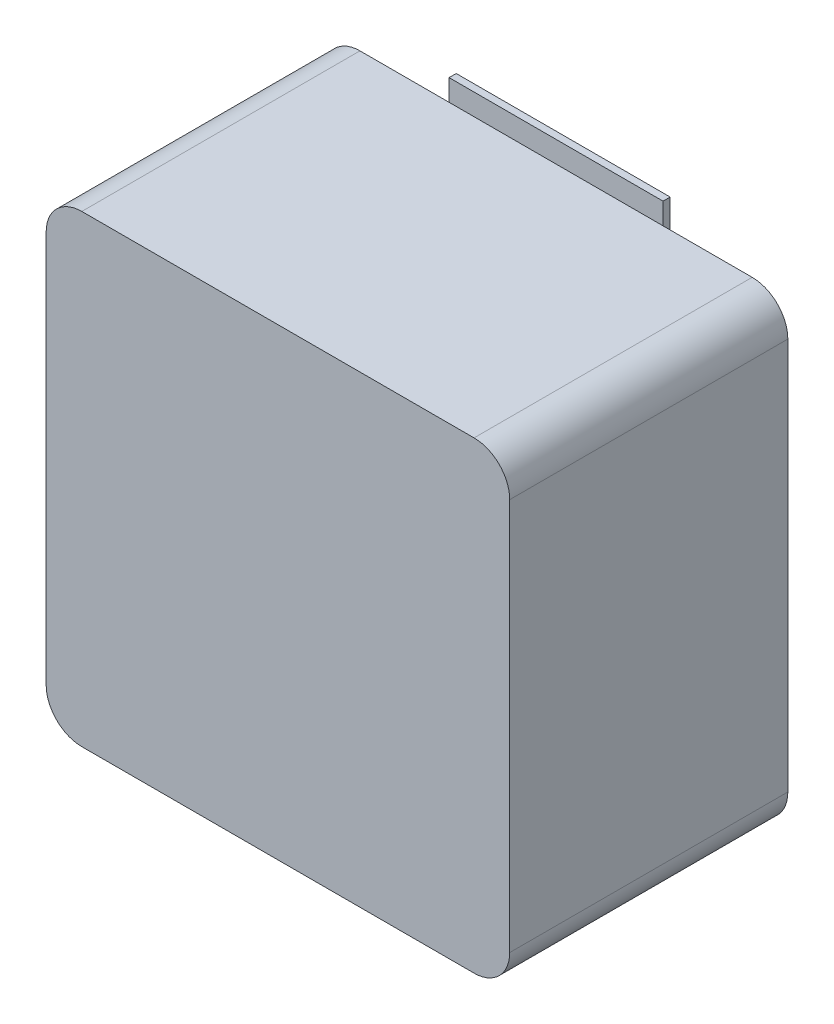
ISO-10303-21;
HEADER;
FILE_DESCRIPTION(('STEP AP214'),'2;1');
FILE_NAME('part.step','',(''),(''),'','','');
FILE_SCHEMA(('AUTOMOTIVE_DESIGN { 1 0 10303 214 1 1 1 1 }'));
ENDSEC;
DATA;
#1=APPLICATION_CONTEXT('core data for automotive mechanical design processes');
#2=APPLICATION_PROTOCOL_DEFINITION('international standard','automotive_design',2000,#1);
#3=PRODUCT_CONTEXT('',#1,'mechanical');
#4=PRODUCT('Part','Part','',(#3));
#5=PRODUCT_RELATED_PRODUCT_CATEGORY('part','',(#4));
#6=PRODUCT_DEFINITION_FORMATION('','',#4);
#7=PRODUCT_DEFINITION_CONTEXT('part definition',#1,'design');
#8=PRODUCT_DEFINITION('design','',#6,#7);
#9=PRODUCT_DEFINITION_SHAPE('','',#8);
#10=(LENGTH_UNIT() NAMED_UNIT(*) SI_UNIT(.MILLI.,.METRE.));
#11=(NAMED_UNIT(*) PLANE_ANGLE_UNIT() SI_UNIT($,.RADIAN.));
#12=(NAMED_UNIT(*) SI_UNIT($,.STERADIAN.) SOLID_ANGLE_UNIT());
#13=UNCERTAINTY_MEASURE_WITH_UNIT(LENGTH_MEASURE(1.E-05),#10,'distance_accuracy_value','');
#14=(GEOMETRIC_REPRESENTATION_CONTEXT(3) GLOBAL_UNCERTAINTY_ASSIGNED_CONTEXT((#13)) GLOBAL_UNIT_ASSIGNED_CONTEXT((#10,
#11,#12)) REPRESENTATION_CONTEXT('',''));
#15=CARTESIAN_POINT('',(0.,0.,0.));
#16=DIRECTION('',(0.,0.,1.));
#17=DIRECTION('',(1.,0.,0.));
#18=AXIS2_PLACEMENT_3D('',#15,#16,#17);
#19=CARTESIAN_POINT('',(0.,0.,0.));
#20=DIRECTION('',(0.,0.,-1.));
#21=DIRECTION('',(0.,-1.,0.));
#22=AXIS2_PLACEMENT_3D('',#19,#20,#21);
#23=PLANE('',#22);
#24=DIRECTION('',(-1.,0.,0.));
#25=VECTOR('',#24,1.);
#26=CARTESIAN_POINT('',(0.,3.25,0.));
#27=LINE('',#26,#25);
#28=CARTESIAN_POINT('',(1.5,3.25,0.));
#29=VERTEX_POINT('',#28);
#30=CARTESIAN_POINT('',(-1.5,3.25,0.));
#31=VERTEX_POINT('',#30);
#32=EDGE_CURVE('E197',#29,#31,#27,.T.);
#33=ORIENTED_EDGE('',*,*,#32,.F.);
#34=DIRECTION('',(0.,-1.,0.));
#35=VECTOR('',#34,1.);
#36=CARTESIAN_POINT('',(1.5,2.915,0.));
#37=LINE('',#36,#35);
#38=CARTESIAN_POINT('',(1.5,3.55,0.));
#39=VERTEX_POINT('',#38);
#40=EDGE_CURVE('E151',#39,#29,#37,.T.);
#41=ORIENTED_EDGE('',*,*,#40,.F.);
#42=DIRECTION('',(-1.,0.,0.));
#43=VECTOR('',#42,1.);
#44=CARTESIAN_POINT('',(0.,3.55,0.));
#45=LINE('',#44,#43);
#46=CARTESIAN_POINT('',(-1.5,3.55,0.));
#47=VERTEX_POINT('',#46);
#48=EDGE_CURVE('E180',#39,#47,#45,.T.);
#49=ORIENTED_EDGE('',*,*,#48,.T.);
#50=DIRECTION('',(0.,-1.,0.));
#51=VECTOR('',#50,1.);
#52=CARTESIAN_POINT('',(-1.5,2.915,0.));
#53=LINE('',#52,#51);
#54=EDGE_CURVE('E28',#47,#31,#53,.T.);
#55=ORIENTED_EDGE('',*,*,#54,.T.);
#56=EDGE_LOOP('',(#33,#41,#49,#55));
#57=FACE_BOUND('',#56,.T.);
#58=ADVANCED_FACE('F17',(#57),#23,.F.);
#59=CARTESIAN_POINT('',(0.,0.,-0.1));
#60=DIRECTION('',(0.,0.,-1.));
#61=DIRECTION('',(0.,-1.,0.));
#62=AXIS2_PLACEMENT_3D('',#59,#60,#61);
#63=PLANE('',#62);
#64=DIRECTION('',(-1.,0.,0.));
#65=VECTOR('',#64,1.);
#66=CARTESIAN_POINT('',(0.,3.55,-0.1));
#67=LINE('',#66,#65);
#68=CARTESIAN_POINT('',(1.5,3.55,-0.1));
#69=VERTEX_POINT('',#68);
#70=CARTESIAN_POINT('',(-1.5,3.55,-0.1));
#71=VERTEX_POINT('',#70);
#72=EDGE_CURVE('E253',#69,#71,#67,.T.);
#73=ORIENTED_EDGE('',*,*,#72,.F.);
#74=DIRECTION('',(0.,-1.,0.));
#75=VECTOR('',#74,1.);
#76=CARTESIAN_POINT('',(1.5,2.915,-0.1));
#77=LINE('',#76,#75);
#78=CARTESIAN_POINT('',(1.5,2.28,-0.1));
#79=VERTEX_POINT('',#78);
#80=EDGE_CURVE('E150',#69,#79,#77,.T.);
#81=ORIENTED_EDGE('',*,*,#80,.T.);
#82=DIRECTION('',(-1.,0.,0.));
#83=VECTOR('',#82,1.);
#84=CARTESIAN_POINT('',(0.,2.28,-0.1));
#85=LINE('',#84,#83);
#86=CARTESIAN_POINT('',(-1.5,2.28,-0.1));
#87=VERTEX_POINT('',#86);
#88=EDGE_CURVE('E146',#79,#87,#85,.T.);
#89=ORIENTED_EDGE('',*,*,#88,.T.);
#90=DIRECTION('',(0.,-1.,0.));
#91=VECTOR('',#90,1.);
#92=CARTESIAN_POINT('',(-1.5,2.915,-0.1));
#93=LINE('',#92,#91);
#94=EDGE_CURVE('E11',#71,#87,#93,.T.);
#95=ORIENTED_EDGE('',*,*,#94,.F.);
#96=EDGE_LOOP('',(#73,#81,#89,#95));
#97=FACE_BOUND('',#96,.T.);
#98=ADVANCED_FACE('F435',(#97),#63,.T.);
#99=CARTESIAN_POINT('',(-1.5,2.915,-0.1));
#100=DIRECTION('',(-1.,0.,0.));
#101=DIRECTION('',(0.,1.,0.));
#102=AXIS2_PLACEMENT_3D('',#99,#100,#101);
#103=PLANE('',#102);
#104=ORIENTED_EDGE('',*,*,#54,.F.);
#105=DIRECTION('',(0.,0.,1.));
#106=VECTOR('',#105,1.);
#107=CARTESIAN_POINT('',(-1.5,3.55,-0.1));
#108=LINE('',#107,#106);
#109=EDGE_CURVE('E261',#71,#47,#108,.T.);
#110=ORIENTED_EDGE('',*,*,#109,.F.);
#111=ORIENTED_EDGE('',*,*,#94,.T.);
#112=DIRECTION('',(0.,0.,1.));
#113=VECTOR('',#112,1.);
#114=CARTESIAN_POINT('',(-1.5,2.28,-0.1));
#115=LINE('',#114,#113);
#116=CARTESIAN_POINT('',(-1.5,2.28,0.));
#117=VERTEX_POINT('',#116);
#118=EDGE_CURVE('E213',#87,#117,#115,.T.);
#119=ORIENTED_EDGE('',*,*,#118,.T.);
#120=DIRECTION('',(0.,-1.,0.));
#121=VECTOR('',#120,1.);
#122=CARTESIAN_POINT('',(-1.5,2.915,0.));
#123=LINE('',#122,#121);
#124=EDGE_CURVE('E165',#31,#117,#123,.T.);
#125=ORIENTED_EDGE('',*,*,#124,.F.);
#126=EDGE_LOOP('',(#104,#110,#111,#119,#125));
#127=FACE_BOUND('',#126,.T.);
#128=ADVANCED_FACE('F440',(#127),#103,.T.);
#129=CARTESIAN_POINT('',(0.,2.28,-0.1));
#130=DIRECTION('',(0.,1.,0.));
#131=DIRECTION('',(1.,0.,0.));
#132=AXIS2_PLACEMENT_3D('',#129,#130,#131);
#133=PLANE('',#132);
#134=DIRECTION('',(-1.,0.,0.));
#135=VECTOR('',#134,1.);
#136=CARTESIAN_POINT('',(0.,2.28,0.));
#137=LINE('',#136,#135);
#138=CARTESIAN_POINT('',(1.5,2.28,0.));
#139=VERTEX_POINT('',#138);
#140=EDGE_CURVE('E144',#139,#117,#137,.T.);
#141=ORIENTED_EDGE('',*,*,#140,.T.);
#142=ORIENTED_EDGE('',*,*,#118,.F.);
#143=ORIENTED_EDGE('',*,*,#88,.F.);
#144=DIRECTION('',(0.,0.,1.));
#145=VECTOR('',#144,1.);
#146=CARTESIAN_POINT('',(1.5,2.28,-0.1));
#147=LINE('',#146,#145);
#148=EDGE_CURVE('E139',#79,#139,#147,.T.);
#149=ORIENTED_EDGE('',*,*,#148,.T.);
#150=EDGE_LOOP('',(#141,#142,#143,#149));
#151=FACE_BOUND('',#150,.T.);
#152=ADVANCED_FACE('F141',(#151),#133,.F.);
#153=CARTESIAN_POINT('',(1.5,2.915,-0.1));
#154=DIRECTION('',(-1.,0.,0.));
#155=DIRECTION('',(0.,1.,0.));
#156=AXIS2_PLACEMENT_3D('',#153,#154,#155);
#157=PLANE('',#156);
#158=ORIENTED_EDGE('',*,*,#40,.T.);
#159=DIRECTION('',(0.,-1.,0.));
#160=VECTOR('',#159,1.);
#161=CARTESIAN_POINT('',(1.5,2.915,0.));
#162=LINE('',#161,#160);
#163=EDGE_CURVE('E154',#29,#139,#162,.T.);
#164=ORIENTED_EDGE('',*,*,#163,.T.);
#165=ORIENTED_EDGE('',*,*,#148,.F.);
#166=ORIENTED_EDGE('',*,*,#80,.F.);
#167=DIRECTION('',(0.,0.,1.));
#168=VECTOR('',#167,1.);
#169=CARTESIAN_POINT('',(1.5,3.55,-0.1));
#170=LINE('',#169,#168);
#171=EDGE_CURVE('E247',#69,#39,#170,.T.);
#172=ORIENTED_EDGE('',*,*,#171,.T.);
#173=EDGE_LOOP('',(#158,#164,#165,#166,#172));
#174=FACE_BOUND('',#173,.T.);
#175=ADVANCED_FACE('F155',(#174),#157,.F.);
#176=CARTESIAN_POINT('',(0.,3.55,-0.1));
#177=DIRECTION('',(0.,1.,0.));
#178=DIRECTION('',(1.,0.,0.));
#179=AXIS2_PLACEMENT_3D('',#176,#177,#178);
#180=PLANE('',#179);
#181=ORIENTED_EDGE('',*,*,#48,.F.);
#182=ORIENTED_EDGE('',*,*,#171,.F.);
#183=ORIENTED_EDGE('',*,*,#72,.T.);
#184=ORIENTED_EDGE('',*,*,#109,.T.);
#185=EDGE_LOOP('',(#181,#182,#183,#184));
#186=FACE_BOUND('',#185,.T.);
#187=ADVANCED_FACE('F430',(#186),#180,.T.);
#188=CARTESIAN_POINT('',(0.,0.,-0.1));
#189=DIRECTION('',(0.,0.,-1.));
#190=DIRECTION('',(0.,-1.,0.));
#191=AXIS2_PLACEMENT_3D('',#188,#189,#190);
#192=PLANE('',#191);
#193=DIRECTION('',(-1.,0.,0.));
#194=VECTOR('',#193,1.);
#195=CARTESIAN_POINT('',(0.,-2.28,-0.1));
#196=LINE('',#195,#194);
#197=CARTESIAN_POINT('',(1.5,-2.28,-0.1));
#198=VERTEX_POINT('',#197);
#199=CARTESIAN_POINT('',(-1.5,-2.28,-0.1));
#200=VERTEX_POINT('',#199);
#201=EDGE_CURVE('E208',#198,#200,#196,.T.);
#202=ORIENTED_EDGE('',*,*,#201,.F.);
#203=DIRECTION('',(0.,-1.,0.));
#204=VECTOR('',#203,1.);
#205=CARTESIAN_POINT('',(1.5,-2.915,-0.1));
#206=LINE('',#205,#204);
#207=CARTESIAN_POINT('',(1.5,-3.55,-0.1));
#208=VERTEX_POINT('',#207);
#209=EDGE_CURVE('E301',#198,#208,#206,.T.);
#210=ORIENTED_EDGE('',*,*,#209,.T.);
#211=DIRECTION('',(-1.,0.,0.));
#212=VECTOR('',#211,1.);
#213=CARTESIAN_POINT('',(0.,-3.55,-0.1));
#214=LINE('',#213,#212);
#215=CARTESIAN_POINT('',(-1.5,-3.55,-0.1));
#216=VERTEX_POINT('',#215);
#217=EDGE_CURVE('E181',#208,#216,#214,.T.);
#218=ORIENTED_EDGE('',*,*,#217,.T.);
#219=DIRECTION('',(0.,-1.,0.));
#220=VECTOR('',#219,1.);
#221=CARTESIAN_POINT('',(-1.5,-2.915,-0.1));
#222=LINE('',#221,#220);
#223=EDGE_CURVE('E178',#200,#216,#222,.T.);
#224=ORIENTED_EDGE('',*,*,#223,.F.);
#225=EDGE_LOOP('',(#202,#210,#218,#224));
#226=FACE_BOUND('',#225,.T.);
#227=ADVANCED_FACE('F414',(#226),#192,.T.);
#228=CARTESIAN_POINT('',(-1.5,-2.915,-0.1));
#229=DIRECTION('',(-1.,0.,0.));
#230=DIRECTION('',(0.,0.,1.));
#231=AXIS2_PLACEMENT_3D('',#228,#229,#230);
#232=PLANE('',#231);
#233=DIRECTION('',(0.,-1.,0.));
#234=VECTOR('',#233,1.);
#235=CARTESIAN_POINT('',(-1.5,-2.915,0.));
#236=LINE('',#235,#234);
#237=CARTESIAN_POINT('',(-1.5,-2.28,0.));
#238=VERTEX_POINT('',#237);
#239=CARTESIAN_POINT('',(-1.5,-3.25,0.));
#240=VERTEX_POINT('',#239);
#241=EDGE_CURVE('E172',#238,#240,#236,.T.);
#242=ORIENTED_EDGE('',*,*,#241,.F.);
#243=DIRECTION('',(0.,0.,1.));
#244=VECTOR('',#243,1.);
#245=CARTESIAN_POINT('',(-1.5,-2.28,-0.1));
#246=LINE('',#245,#244);
#247=EDGE_CURVE('E211',#200,#238,#246,.T.);
#248=ORIENTED_EDGE('',*,*,#247,.F.);
#249=ORIENTED_EDGE('',*,*,#223,.T.);
#250=DIRECTION('',(0.,0.,1.));
#251=VECTOR('',#250,1.);
#252=CARTESIAN_POINT('',(-1.5,-3.55,-0.1));
#253=LINE('',#252,#251);
#254=CARTESIAN_POINT('',(-1.5,-3.55,0.));
#255=VERTEX_POINT('',#254);
#256=EDGE_CURVE('E297',#216,#255,#253,.T.);
#257=ORIENTED_EDGE('',*,*,#256,.T.);
#258=DIRECTION('',(0.,-1.,0.));
#259=VECTOR('',#258,1.);
#260=CARTESIAN_POINT('',(-1.5,-2.915,0.));
#261=LINE('',#260,#259);
#262=EDGE_CURVE('E207',#240,#255,#261,.T.);
#263=ORIENTED_EDGE('',*,*,#262,.F.);
#264=EDGE_LOOP('',(#242,#248,#249,#257,#263));
#265=FACE_BOUND('',#264,.T.);
#266=ADVANCED_FACE('F422',(#265),#232,.T.);
#267=CARTESIAN_POINT('',(0.,-3.55,-0.1));
#268=DIRECTION('',(0.,1.,0.));
#269=DIRECTION('',(1.,0.,0.));
#270=AXIS2_PLACEMENT_3D('',#267,#268,#269);
#271=PLANE('',#270);
#272=DIRECTION('',(-1.,0.,0.));
#273=VECTOR('',#272,1.);
#274=CARTESIAN_POINT('',(0.,-3.55,0.));
#275=LINE('',#274,#273);
#276=CARTESIAN_POINT('',(1.5,-3.55,0.));
#277=VERTEX_POINT('',#276);
#278=EDGE_CURVE('E21',#277,#255,#275,.T.);
#279=ORIENTED_EDGE('',*,*,#278,.T.);
#280=ORIENTED_EDGE('',*,*,#256,.F.);
#281=ORIENTED_EDGE('',*,*,#217,.F.);
#282=DIRECTION('',(0.,0.,1.));
#283=VECTOR('',#282,1.);
#284=CARTESIAN_POINT('',(1.5,-3.55,-0.1));
#285=LINE('',#284,#283);
#286=EDGE_CURVE('E332',#208,#277,#285,.T.);
#287=ORIENTED_EDGE('',*,*,#286,.T.);
#288=EDGE_LOOP('',(#279,#280,#281,#287));
#289=FACE_BOUND('',#288,.T.);
#290=ADVANCED_FACE('F19',(#289),#271,.F.);
#291=CARTESIAN_POINT('',(1.5,-2.915,-0.1));
#292=DIRECTION('',(-1.,0.,0.));
#293=DIRECTION('',(0.,0.,1.));
#294=AXIS2_PLACEMENT_3D('',#291,#292,#293);
#295=PLANE('',#294);
#296=DIRECTION('',(0.,-1.,0.));
#297=VECTOR('',#296,1.);
#298=CARTESIAN_POINT('',(1.5,-2.915,0.));
#299=LINE('',#298,#297);
#300=CARTESIAN_POINT('',(1.5,-2.28,0.));
#301=VERTEX_POINT('',#300);
#302=CARTESIAN_POINT('',(1.5,-3.25,0.));
#303=VERTEX_POINT('',#302);
#304=EDGE_CURVE('E203',#301,#303,#299,.T.);
#305=ORIENTED_EDGE('',*,*,#304,.T.);
#306=DIRECTION('',(0.,-1.,0.));
#307=VECTOR('',#306,1.);
#308=CARTESIAN_POINT('',(1.5,-2.915,0.));
#309=LINE('',#308,#307);
#310=EDGE_CURVE('E160',#303,#277,#309,.T.);
#311=ORIENTED_EDGE('',*,*,#310,.T.);
#312=ORIENTED_EDGE('',*,*,#286,.F.);
#313=ORIENTED_EDGE('',*,*,#209,.F.);
#314=DIRECTION('',(0.,0.,1.));
#315=VECTOR('',#314,1.);
#316=CARTESIAN_POINT('',(1.5,-2.28,-0.1));
#317=LINE('',#316,#315);
#318=EDGE_CURVE('E212',#198,#301,#317,.T.);
#319=ORIENTED_EDGE('',*,*,#318,.T.);
#320=EDGE_LOOP('',(#305,#311,#312,#313,#319));
#321=FACE_BOUND('',#320,.T.);
#322=ADVANCED_FACE('F369',(#321),#295,.F.);
#323=CARTESIAN_POINT('',(0.,-2.28,-0.1));
#324=DIRECTION('',(0.,1.,0.));
#325=DIRECTION('',(1.,0.,0.));
#326=AXIS2_PLACEMENT_3D('',#323,#324,#325);
#327=PLANE('',#326);
#328=DIRECTION('',(-1.,0.,0.));
#329=VECTOR('',#328,1.);
#330=CARTESIAN_POINT('',(0.,-2.28,0.));
#331=LINE('',#330,#329);
#332=EDGE_CURVE('E199',#301,#238,#331,.T.);
#333=ORIENTED_EDGE('',*,*,#332,.F.);
#334=ORIENTED_EDGE('',*,*,#318,.F.);
#335=ORIENTED_EDGE('',*,*,#201,.T.);
#336=ORIENTED_EDGE('',*,*,#247,.T.);
#337=EDGE_LOOP('',(#333,#334,#335,#336));
#338=FACE_BOUND('',#337,.T.);
#339=ADVANCED_FACE('F417',(#338),#327,.T.);
#340=CARTESIAN_POINT('',(0.,0.,0.));
#341=DIRECTION('',(0.,0.,-1.));
#342=DIRECTION('',(0.,-1.,0.));
#343=AXIS2_PLACEMENT_3D('',#340,#341,#342);
#344=PLANE('',#343);
#345=ORIENTED_EDGE('',*,*,#310,.F.);
#346=DIRECTION('',(-1.,0.,0.));
#347=VECTOR('',#346,1.);
#348=CARTESIAN_POINT('',(0.,-3.25,0.));
#349=LINE('',#348,#347);
#350=EDGE_CURVE('E185',#303,#240,#349,.T.);
#351=ORIENTED_EDGE('',*,*,#350,.T.);
#352=ORIENTED_EDGE('',*,*,#262,.T.);
#353=ORIENTED_EDGE('',*,*,#278,.F.);
#354=EDGE_LOOP('',(#345,#351,#352,#353));
#355=FACE_BOUND('',#354,.T.);
#356=ADVANCED_FACE('F366',(#355),#344,.F.);
#357=CARTESIAN_POINT('',(0.,0.,0.));
#358=DIRECTION('',(0.,0.,1.));
#359=DIRECTION('',(1.,0.,0.));
#360=AXIS2_PLACEMENT_3D('',#357,#358,#359);
#361=PLANE('',#360);
#362=DIRECTION('',(0.,1.,0.));
#363=VECTOR('',#362,1.);
#364=CARTESIAN_POINT('',(3.25,0.,0.));
#365=LINE('',#364,#363);
#366=CARTESIAN_POINT('',(3.25,-2.75,0.));
#367=VERTEX_POINT('',#366);
#368=CARTESIAN_POINT('',(3.25,2.75,0.));
#369=VERTEX_POINT('',#368);
#370=EDGE_CURVE('E279',#367,#369,#365,.T.);
#371=ORIENTED_EDGE('',*,*,#370,.F.);
#372=CARTESIAN_POINT('',(2.75,-2.75,0.));
#373=DIRECTION('',(0.,0.,-1.));
#374=DIRECTION('',(1.,0.,0.));
#375=AXIS2_PLACEMENT_3D('',#372,#373,#374);
#376=CIRCLE('',#375,0.5);
#377=CARTESIAN_POINT('',(2.75,-3.25,0.));
#378=VERTEX_POINT('',#377);
#379=EDGE_CURVE('E339',#367,#378,#376,.T.);
#380=ORIENTED_EDGE('',*,*,#379,.T.);
#381=DIRECTION('',(-1.,0.,0.));
#382=VECTOR('',#381,1.);
#383=CARTESIAN_POINT('',(0.,-3.25,0.));
#384=LINE('',#383,#382);
#385=EDGE_CURVE('E292',#378,#303,#384,.T.);
#386=ORIENTED_EDGE('',*,*,#385,.T.);
#387=ORIENTED_EDGE('',*,*,#304,.F.);
#388=ORIENTED_EDGE('',*,*,#332,.T.);
#389=ORIENTED_EDGE('',*,*,#241,.T.);
#390=DIRECTION('',(-1.,0.,0.));
#391=VECTOR('',#390,1.);
#392=CARTESIAN_POINT('',(0.,-3.25,0.));
#393=LINE('',#392,#391);
#394=CARTESIAN_POINT('',(-2.75,-3.25,0.));
#395=VERTEX_POINT('',#394);
#396=EDGE_CURVE('E182',#240,#395,#393,.T.);
#397=ORIENTED_EDGE('',*,*,#396,.T.);
#398=CARTESIAN_POINT('',(-2.75,-2.75,0.));
#399=DIRECTION('',(0.,0.,-1.));
#400=DIRECTION('',(1.,0.,0.));
#401=AXIS2_PLACEMENT_3D('',#398,#399,#400);
#402=CIRCLE('',#401,0.5);
#403=CARTESIAN_POINT('',(-3.25,-2.75,0.));
#404=VERTEX_POINT('',#403);
#405=EDGE_CURVE('E191',#395,#404,#402,.T.);
#406=ORIENTED_EDGE('',*,*,#405,.T.);
#407=DIRECTION('',(0.,1.,0.));
#408=VECTOR('',#407,1.);
#409=CARTESIAN_POINT('',(-3.25,0.,0.));
#410=LINE('',#409,#408);
#411=CARTESIAN_POINT('',(-3.25,2.75,0.));
#412=VERTEX_POINT('',#411);
#413=EDGE_CURVE('E268',#404,#412,#410,.T.);
#414=ORIENTED_EDGE('',*,*,#413,.T.);
#415=CARTESIAN_POINT('',(-2.75,2.75,0.));
#416=DIRECTION('',(0.,0.,-1.));
#417=DIRECTION('',(1.,0.,0.));
#418=AXIS2_PLACEMENT_3D('',#415,#416,#417);
#419=CIRCLE('',#418,0.5);
#420=CARTESIAN_POINT('',(-2.75,3.25,0.));
#421=VERTEX_POINT('',#420);
#422=EDGE_CURVE('E321',#412,#421,#419,.T.);
#423=ORIENTED_EDGE('',*,*,#422,.T.);
#424=DIRECTION('',(-1.,0.,0.));
#425=VECTOR('',#424,1.);
#426=CARTESIAN_POINT('',(0.,3.25,0.));
#427=LINE('',#426,#425);
#428=EDGE_CURVE('E275',#31,#421,#427,.T.);
#429=ORIENTED_EDGE('',*,*,#428,.F.);
#430=ORIENTED_EDGE('',*,*,#124,.T.);
#431=ORIENTED_EDGE('',*,*,#140,.F.);
#432=ORIENTED_EDGE('',*,*,#163,.F.);
#433=DIRECTION('',(-1.,0.,0.));
#434=VECTOR('',#433,1.);
#435=CARTESIAN_POINT('',(0.,3.25,0.));
#436=LINE('',#435,#434);
#437=CARTESIAN_POINT('',(2.75,3.25,0.));
#438=VERTEX_POINT('',#437);
#439=EDGE_CURVE('E193',#438,#29,#436,.T.);
#440=ORIENTED_EDGE('',*,*,#439,.F.);
#441=CARTESIAN_POINT('',(2.75,2.75,0.));
#442=DIRECTION('',(0.,0.,-1.));
#443=DIRECTION('',(1.,0.,0.));
#444=AXIS2_PLACEMENT_3D('',#441,#442,#443);
#445=CIRCLE('',#444,0.5);
#446=EDGE_CURVE('E291',#438,#369,#445,.T.);
#447=ORIENTED_EDGE('',*,*,#446,.T.);
#448=EDGE_LOOP('',(#371,#380,#386,#387,#388,#389,#397,#406,#414,#423,#429,#430,#431,#432,#440,#447));
#449=FACE_BOUND('',#448,.T.);
#450=ADVANCED_FACE('F162',(#449),#361,.F.);
#451=CARTESIAN_POINT('',(-3.25,0.,3.9));
#452=DIRECTION('',(-1.,0.,0.));
#453=DIRECTION('',(0.,0.,1.));
#454=AXIS2_PLACEMENT_3D('',#451,#452,#453);
#455=PLANE('',#454);
#456=DIRECTION('',(0.,1.,0.));
#457=VECTOR('',#456,1.);
#458=CARTESIAN_POINT('',(-3.25,0.,3.9));
#459=LINE('',#458,#457);
#460=CARTESIAN_POINT('',(-3.25,-2.75,3.9));
#461=VERTEX_POINT('',#460);
#462=CARTESIAN_POINT('',(-3.25,2.75,3.9));
#463=VERTEX_POINT('',#462);
#464=EDGE_CURVE('E198',#461,#463,#459,.T.);
#465=ORIENTED_EDGE('',*,*,#464,.T.);
#466=DIRECTION('',(0.,0.,-1.));
#467=VECTOR('',#466,1.);
#468=CARTESIAN_POINT('',(-3.25,2.75,0.));
#469=LINE('',#468,#467);
#470=EDGE_CURVE('E295',#463,#412,#469,.T.);
#471=ORIENTED_EDGE('',*,*,#470,.T.);
#472=ORIENTED_EDGE('',*,*,#413,.F.);
#473=DIRECTION('',(0.,0.,1.));
#474=VECTOR('',#473,1.);
#475=CARTESIAN_POINT('',(-3.25,-2.75,3.9));
#476=LINE('',#475,#474);
#477=EDGE_CURVE('E187',#404,#461,#476,.T.);
#478=ORIENTED_EDGE('',*,*,#477,.T.);
#479=EDGE_LOOP('',(#465,#471,#472,#478));
#480=FACE_BOUND('',#479,.T.);
#481=ADVANCED_FACE('F472',(#480),#455,.T.);
#482=CARTESIAN_POINT('',(3.25,0.,3.9));
#483=DIRECTION('',(-1.,0.,0.));
#484=DIRECTION('',(0.,0.,1.));
#485=AXIS2_PLACEMENT_3D('',#482,#483,#484);
#486=PLANE('',#485);
#487=DIRECTION('',(0.,1.,0.));
#488=VECTOR('',#487,1.);
#489=CARTESIAN_POINT('',(3.25,0.,3.9));
#490=LINE('',#489,#488);
#491=CARTESIAN_POINT('',(3.25,-2.75,3.9));
#492=VERTEX_POINT('',#491);
#493=CARTESIAN_POINT('',(3.25,2.75,3.9));
#494=VERTEX_POINT('',#493);
#495=EDGE_CURVE('E228',#492,#494,#490,.T.);
#496=ORIENTED_EDGE('',*,*,#495,.F.);
#497=DIRECTION('',(0.,0.,-1.));
#498=VECTOR('',#497,1.);
#499=CARTESIAN_POINT('',(3.25,-2.75,0.));
#500=LINE('',#499,#498);
#501=EDGE_CURVE('E240',#492,#367,#500,.T.);
#502=ORIENTED_EDGE('',*,*,#501,.T.);
#503=ORIENTED_EDGE('',*,*,#370,.T.);
#504=DIRECTION('',(0.,0.,1.));
#505=VECTOR('',#504,1.);
#506=CARTESIAN_POINT('',(3.25,2.75,3.9));
#507=LINE('',#506,#505);
#508=EDGE_CURVE('E244',#369,#494,#507,.T.);
#509=ORIENTED_EDGE('',*,*,#508,.T.);
#510=EDGE_LOOP('',(#496,#502,#503,#509));
#511=FACE_BOUND('',#510,.T.);
#512=ADVANCED_FACE('F468',(#511),#486,.F.);
#513=CARTESIAN_POINT('',(0.,3.25,3.9));
#514=DIRECTION('',(0.,-1.,0.));
#515=DIRECTION('',(0.,0.,-1.));
#516=AXIS2_PLACEMENT_3D('',#513,#514,#515);
#517=PLANE('',#516);
#518=DIRECTION('',(-1.,0.,0.));
#519=VECTOR('',#518,1.);
#520=CARTESIAN_POINT('',(0.,3.25,3.9));
#521=LINE('',#520,#519);
#522=CARTESIAN_POINT('',(2.75,3.25,3.9));
#523=VERTEX_POINT('',#522);
#524=CARTESIAN_POINT('',(-2.75,3.25,3.9));
#525=VERTEX_POINT('',#524);
#526=EDGE_CURVE('E232',#523,#525,#521,.T.);
#527=ORIENTED_EDGE('',*,*,#526,.F.);
#528=DIRECTION('',(0.,0.,-1.));
#529=VECTOR('',#528,1.);
#530=CARTESIAN_POINT('',(2.75,3.25,3.9));
#531=LINE('',#530,#529);
#532=EDGE_CURVE('E325',#523,#438,#531,.T.);
#533=ORIENTED_EDGE('',*,*,#532,.T.);
#534=ORIENTED_EDGE('',*,*,#439,.T.);
#535=ORIENTED_EDGE('',*,*,#32,.T.);
#536=ORIENTED_EDGE('',*,*,#428,.T.);
#537=DIRECTION('',(0.,0.,1.));
#538=VECTOR('',#537,1.);
#539=CARTESIAN_POINT('',(-2.75,3.25,3.9));
#540=LINE('',#539,#538);
#541=EDGE_CURVE('E176',#421,#525,#540,.T.);
#542=ORIENTED_EDGE('',*,*,#541,.T.);
#543=EDGE_LOOP('',(#527,#533,#534,#535,#536,#542));
#544=FACE_BOUND('',#543,.T.);
#545=ADVANCED_FACE('F471',(#544),#517,.F.);
#546=CARTESIAN_POINT('',(0.,0.,3.9));
#547=DIRECTION('',(0.,0.,1.));
#548=DIRECTION('',(1.,0.,0.));
#549=AXIS2_PLACEMENT_3D('',#546,#547,#548);
#550=PLANE('',#549);
#551=DIRECTION('',(-1.,0.,0.));
#552=VECTOR('',#551,1.);
#553=CARTESIAN_POINT('',(0.,-3.25,3.9));
#554=LINE('',#553,#552);
#555=CARTESIAN_POINT('',(2.75,-3.25,3.9));
#556=VERTEX_POINT('',#555);
#557=CARTESIAN_POINT('',(-2.75,-3.25,3.9));
#558=VERTEX_POINT('',#557);
#559=EDGE_CURVE('E186',#556,#558,#554,.T.);
#560=ORIENTED_EDGE('',*,*,#559,.F.);
#561=CARTESIAN_POINT('',(2.75,-2.75,3.9));
#562=DIRECTION('',(0.,0.,1.));
#563=DIRECTION('',(1.,0.,0.));
#564=AXIS2_PLACEMENT_3D('',#561,#562,#563);
#565=CIRCLE('',#564,0.5);
#566=EDGE_CURVE('E280',#556,#492,#565,.T.);
#567=ORIENTED_EDGE('',*,*,#566,.T.);
#568=ORIENTED_EDGE('',*,*,#495,.T.);
#569=CARTESIAN_POINT('',(2.75,2.75,3.9));
#570=DIRECTION('',(0.,0.,1.));
#571=DIRECTION('',(1.,0.,0.));
#572=AXIS2_PLACEMENT_3D('',#569,#570,#571);
#573=CIRCLE('',#572,0.5);
#574=EDGE_CURVE('E241',#494,#523,#573,.T.);
#575=ORIENTED_EDGE('',*,*,#574,.T.);
#576=ORIENTED_EDGE('',*,*,#526,.T.);
#577=CARTESIAN_POINT('',(-2.75,2.75,3.9));
#578=DIRECTION('',(0.,0.,1.));
#579=DIRECTION('',(1.,0.,0.));
#580=AXIS2_PLACEMENT_3D('',#577,#578,#579);
#581=CIRCLE('',#580,0.5);
#582=EDGE_CURVE('E329',#525,#463,#581,.T.);
#583=ORIENTED_EDGE('',*,*,#582,.T.);
#584=ORIENTED_EDGE('',*,*,#464,.F.);
#585=CARTESIAN_POINT('',(-2.75,-2.75,3.9));
#586=DIRECTION('',(0.,0.,1.));
#587=DIRECTION('',(1.,0.,0.));
#588=AXIS2_PLACEMENT_3D('',#585,#586,#587);
#589=CIRCLE('',#588,0.5);
#590=EDGE_CURVE('E192',#461,#558,#589,.T.);
#591=ORIENTED_EDGE('',*,*,#590,.T.);
#592=EDGE_LOOP('',(#560,#567,#568,#575,#576,#583,#584,#591));
#593=FACE_BOUND('',#592,.T.);
#594=ADVANCED_FACE('F477',(#593),#550,.T.);
#595=CARTESIAN_POINT('',(0.,-3.25,3.9));
#596=DIRECTION('',(0.,-1.,0.));
#597=DIRECTION('',(0.,0.,-1.));
#598=AXIS2_PLACEMENT_3D('',#595,#596,#597);
#599=PLANE('',#598);
#600=ORIENTED_EDGE('',*,*,#385,.F.);
#601=DIRECTION('',(0.,0.,1.));
#602=VECTOR('',#601,1.);
#603=CARTESIAN_POINT('',(2.75,-3.25,3.9));
#604=LINE('',#603,#602);
#605=EDGE_CURVE('E284',#378,#556,#604,.T.);
#606=ORIENTED_EDGE('',*,*,#605,.T.);
#607=ORIENTED_EDGE('',*,*,#559,.T.);
#608=DIRECTION('',(0.,0.,-1.));
#609=VECTOR('',#608,1.);
#610=CARTESIAN_POINT('',(-2.75,-3.25,3.9));
#611=LINE('',#610,#609);
#612=EDGE_CURVE('E236',#558,#395,#611,.T.);
#613=ORIENTED_EDGE('',*,*,#612,.T.);
#614=ORIENTED_EDGE('',*,*,#396,.F.);
#615=ORIENTED_EDGE('',*,*,#350,.F.);
#616=EDGE_LOOP('',(#600,#606,#607,#613,#614,#615));
#617=FACE_BOUND('',#616,.T.);
#618=ADVANCED_FACE('F377',(#617),#599,.T.);
#619=CARTESIAN_POINT('',(-2.75,2.75,3.9));
#620=DIRECTION('',(0.,0.,-1.));
#621=DIRECTION('',(1.,0.,0.));
#622=AXIS2_PLACEMENT_3D('',#619,#620,#621);
#623=CYLINDRICAL_SURFACE('',#622,0.5);
#624=ORIENTED_EDGE('',*,*,#582,.F.);
#625=ORIENTED_EDGE('',*,*,#541,.F.);
#626=ORIENTED_EDGE('',*,*,#422,.F.);
#627=ORIENTED_EDGE('',*,*,#470,.F.);
#628=EDGE_LOOP('',(#624,#625,#626,#627));
#629=FACE_BOUND('',#628,.T.);
#630=ADVANCED_FACE('F443',(#629),#623,.T.);
#631=CARTESIAN_POINT('',(2.75,2.75,3.9));
#632=DIRECTION('',(0.,0.,1.));
#633=DIRECTION('',(-1.,0.,0.));
#634=AXIS2_PLACEMENT_3D('',#631,#632,#633);
#635=CYLINDRICAL_SURFACE('',#634,0.5);
#636=ORIENTED_EDGE('',*,*,#574,.F.);
#637=ORIENTED_EDGE('',*,*,#508,.F.);
#638=ORIENTED_EDGE('',*,*,#446,.F.);
#639=ORIENTED_EDGE('',*,*,#532,.F.);
#640=EDGE_LOOP('',(#636,#637,#638,#639));
#641=FACE_BOUND('',#640,.T.);
#642=ADVANCED_FACE('F461',(#641),#635,.T.);
#643=CARTESIAN_POINT('',(-2.75,-2.75,3.9));
#644=DIRECTION('',(0.,0.,1.));
#645=DIRECTION('',(-1.,0.,0.));
#646=AXIS2_PLACEMENT_3D('',#643,#644,#645);
#647=CYLINDRICAL_SURFACE('',#646,0.5);
#648=ORIENTED_EDGE('',*,*,#590,.F.);
#649=ORIENTED_EDGE('',*,*,#477,.F.);
#650=ORIENTED_EDGE('',*,*,#405,.F.);
#651=ORIENTED_EDGE('',*,*,#612,.F.);
#652=EDGE_LOOP('',(#648,#649,#650,#651));
#653=FACE_BOUND('',#652,.T.);
#654=ADVANCED_FACE('F447',(#653),#647,.T.);
#655=CARTESIAN_POINT('',(2.75,-2.75,3.9));
#656=DIRECTION('',(0.,0.,-1.));
#657=DIRECTION('',(1.,0.,0.));
#658=AXIS2_PLACEMENT_3D('',#655,#656,#657);
#659=CYLINDRICAL_SURFACE('',#658,0.5);
#660=ORIENTED_EDGE('',*,*,#566,.F.);
#661=ORIENTED_EDGE('',*,*,#605,.F.);
#662=ORIENTED_EDGE('',*,*,#379,.F.);
#663=ORIENTED_EDGE('',*,*,#501,.F.);
#664=EDGE_LOOP('',(#660,#661,#662,#663));
#665=FACE_BOUND('',#664,.T.);
#666=ADVANCED_FACE('F385',(#665),#659,.T.);
#667=CLOSED_SHELL('',(#58,#98,#128,#152,#175,#187,#227,#266,#290,#322,#339,#356,#450,#481,#512,
#545,#594,#618,#630,#642,#654,#666));
#668=MANIFOLD_SOLID_BREP('B1',#667);
#669=ADVANCED_BREP_SHAPE_REPRESENTATION('',(#18,#668),#14);
#670=SHAPE_DEFINITION_REPRESENTATION(#9,#669);
ENDSEC;
END-ISO-10303-21;
